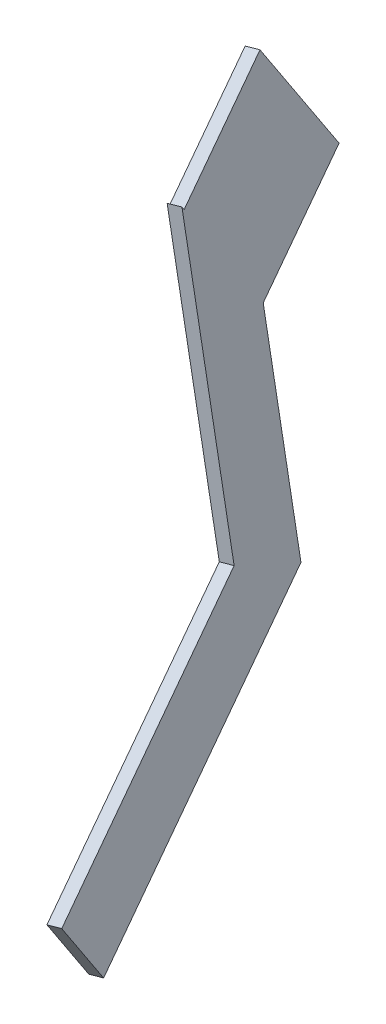
ISO-10303-21;
HEADER;
FILE_DESCRIPTION(('STEP AP214'),'2;1');
FILE_NAME('part.step','',(''),(''),'','','');
FILE_SCHEMA(('AUTOMOTIVE_DESIGN { 1 0 10303 214 1 1 1 1 }'));
ENDSEC;
DATA;
#1=APPLICATION_CONTEXT('core data for automotive mechanical design processes');
#2=APPLICATION_PROTOCOL_DEFINITION('international standard','automotive_design',2000,#1);
#3=PRODUCT_CONTEXT('',#1,'mechanical');
#4=PRODUCT('Part','Part','',(#3));
#5=PRODUCT_RELATED_PRODUCT_CATEGORY('part','',(#4));
#6=PRODUCT_DEFINITION_FORMATION('','',#4);
#7=PRODUCT_DEFINITION_CONTEXT('part definition',#1,'design');
#8=PRODUCT_DEFINITION('design','',#6,#7);
#9=PRODUCT_DEFINITION_SHAPE('','',#8);
#10=(LENGTH_UNIT() NAMED_UNIT(*) SI_UNIT(.MILLI.,.METRE.));
#11=(NAMED_UNIT(*) PLANE_ANGLE_UNIT() SI_UNIT($,.RADIAN.));
#12=(NAMED_UNIT(*) SI_UNIT($,.STERADIAN.) SOLID_ANGLE_UNIT());
#13=UNCERTAINTY_MEASURE_WITH_UNIT(LENGTH_MEASURE(1.E-05),#10,'distance_accuracy_value','');
#14=(GEOMETRIC_REPRESENTATION_CONTEXT(3) GLOBAL_UNCERTAINTY_ASSIGNED_CONTEXT((#13)) GLOBAL_UNIT_ASSIGNED_CONTEXT((#10,
#11,#12)) REPRESENTATION_CONTEXT('',''));
#15=CARTESIAN_POINT('',(0.,0.,0.));
#16=DIRECTION('',(0.,0.,1.));
#17=DIRECTION('',(1.,0.,0.));
#18=AXIS2_PLACEMENT_3D('',#15,#16,#17);
#19=CARTESIAN_POINT('',(5.31176497403256,-389.635259632626,105.833297296979));
#20=DIRECTION('',(-0.233089191441155,0.53411353830883,-0.812645160588883));
#21=DIRECTION('',(0.,0.835663201942741,0.54924221698519));
#22=AXIS2_PLACEMENT_3D('',#19,#20,#21);
#23=PLANE('',#22);
#24=DIRECTION('',(0.,-0.835663201942741,-0.54924221698519));
#25=VECTOR('',#24,1.);
#26=CARTESIAN_POINT('',(0.449488169814938,-390.275371753938,106.807217597269));
#27=LINE('',#26,#25);
#28=CARTESIAN_POINT('',(0.449488169814938,-390.275371753938,106.807217597269));
#29=VERTEX_POINT('',#28);
#30=CARTESIAN_POINT('',(0.449488169814938,-391.577302615747,105.951519522687));
#31=VERTEX_POINT('',#30);
#32=EDGE_CURVE('E137',#29,#31,#27,.T.);
#33=ORIENTED_EDGE('',*,*,#32,.F.);
#34=DIRECTION('',(-0.972455360843524,-0.128022424262425,0.19478406005796));
#35=VECTOR('',#34,1.);
#36=CARTESIAN_POINT('',(5.31176497403256,-389.635259632626,105.833297296979));
#37=LINE('',#36,#35);
#38=CARTESIAN_POINT('',(5.31176497403256,-389.635259632626,105.833297296979));
#39=VERTEX_POINT('',#38);
#40=EDGE_CURVE('E11',#39,#29,#37,.T.);
#41=ORIENTED_EDGE('',*,*,#40,.F.);
#42=DIRECTION('',(0.,-0.835663201942741,-0.54924221698519));
#43=VECTOR('',#42,1.);
#44=CARTESIAN_POINT('',(5.31176497403256,-389.635259632626,105.833297296979));
#45=LINE('',#44,#43);
#46=CARTESIAN_POINT('',(5.31176497403256,-390.937190494435,104.977599222397));
#47=VERTEX_POINT('',#46);
#48=EDGE_CURVE('E160',#39,#47,#45,.T.);
#49=ORIENTED_EDGE('',*,*,#48,.T.);
#50=DIRECTION('',(-0.972455360843524,-0.128022424262425,0.19478406005796));
#51=VECTOR('',#50,1.);
#52=CARTESIAN_POINT('',(5.31176497403256,-390.937190494435,104.977599222397));
#53=LINE('',#52,#51);
#54=EDGE_CURVE('E37',#47,#31,#53,.T.);
#55=ORIENTED_EDGE('',*,*,#54,.T.);
#56=EDGE_LOOP('',(#33,#41,#49,#55));
#57=FACE_BOUND('',#56,.T.);
#58=ADVANCED_FACE('F34',(#57),#23,.T.);
#59=CARTESIAN_POINT('',(5.31176497403256,-389.635259632626,105.833297296979));
#60=DIRECTION('',(0.199796433050453,-0.0274262930988744,0.979453512825989));
#61=DIRECTION('',(0.979822094001318,0.,-0.199871619063016));
#62=AXIS2_PLACEMENT_3D('',#59,#60,#61);
#63=PLANE('',#62);
#64=DIRECTION('',(-0.120049808442193,0.99139197965932,0.0522492694701705));
#65=VECTOR('',#64,1.);
#66=CARTESIAN_POINT('',(0.449488169814938,-390.275371753938,106.807217597269));
#67=LINE('',#66,#65);
#68=CARTESIAN_POINT('',(14.763018810499,-508.478971259181,100.577540688831));
#69=VERTEX_POINT('',#68);
#70=EDGE_CURVE('E158',#69,#29,#67,.T.);
#71=ORIENTED_EDGE('',*,*,#70,.F.);
#72=DIRECTION('',(-0.972455360843524,-0.128022424262425,0.19478406005796));
#73=VECTOR('',#72,1.);
#74=CARTESIAN_POINT('',(19.6252956147166,-507.838859137869,99.6036203885415));
#75=LINE('',#74,#73);
#76=CARTESIAN_POINT('',(19.6252956147166,-507.838859137869,99.6036203885415));
#77=VERTEX_POINT('',#76);
#78=EDGE_CURVE('E43',#77,#69,#75,.T.);
#79=ORIENTED_EDGE('',*,*,#78,.F.);
#80=DIRECTION('',(-0.120049808442193,0.99139197965932,0.0522492694701705));
#81=VECTOR('',#80,1.);
#82=CARTESIAN_POINT('',(5.31176497403256,-389.635259632626,105.833297296979));
#83=LINE('',#82,#81);
#84=EDGE_CURVE('E127',#77,#39,#83,.T.);
#85=ORIENTED_EDGE('',*,*,#84,.T.);
#86=ORIENTED_EDGE('',*,*,#40,.T.);
#87=EDGE_LOOP('',(#71,#79,#85,#86));
#88=FACE_BOUND('',#87,.T.);
#89=ADVANCED_FACE('F174',(#88),#63,.T.);
#90=CARTESIAN_POINT('',(19.6252956147166,-507.838859137869,99.6036203885415));
#91=DIRECTION('',(0.,0.835663201942739,0.549242216985193));
#92=DIRECTION('',(0.,-0.549242216985193,0.835663201942739));
#93=AXIS2_PLACEMENT_3D('',#90,#91,#92);
#94=PLANE('',#93);
#95=DIRECTION('',(-0.233089191441155,0.534113538308833,-0.81264516058888));
#96=VECTOR('',#95,1.);
#97=CARTESIAN_POINT('',(14.763018810499,-508.478971259181,100.577540688831));
#98=LINE('',#97,#96);
#99=CARTESIAN_POINT('',(42.0544055204392,-571.01597278583,195.726582986623));
#100=VERTEX_POINT('',#99);
#101=EDGE_CURVE('E114',#100,#69,#98,.T.);
#102=ORIENTED_EDGE('',*,*,#101,.F.);
#103=DIRECTION('',(-0.972455360843524,-0.128022424262425,0.19478406005796));
#104=VECTOR('',#103,1.);
#105=CARTESIAN_POINT('',(46.9166823246568,-570.375860664518,194.752662686333));
#106=LINE('',#105,#104);
#107=CARTESIAN_POINT('',(46.9166823246568,-570.375860664518,194.752662686333));
#108=VERTEX_POINT('',#107);
#109=EDGE_CURVE('E109',#108,#100,#106,.T.);
#110=ORIENTED_EDGE('',*,*,#109,.F.);
#111=DIRECTION('',(-0.233089191441155,0.534113538308833,-0.81264516058888));
#112=VECTOR('',#111,1.);
#113=CARTESIAN_POINT('',(19.6252956147166,-507.838859137869,99.6036203885415));
#114=LINE('',#113,#112);
#115=EDGE_CURVE('E112',#108,#77,#114,.T.);
#116=ORIENTED_EDGE('',*,*,#115,.T.);
#117=ORIENTED_EDGE('',*,*,#78,.T.);
#118=EDGE_LOOP('',(#102,#110,#116,#117));
#119=FACE_BOUND('',#118,.T.);
#120=ADVANCED_FACE('F111',(#119),#94,.T.);
#121=CARTESIAN_POINT('',(46.9166823246567,-595.4457567228,178.275396176777));
#122=DIRECTION('',(0.233089191441155,-0.534113538308845,0.812645160588873));
#123=DIRECTION('',(0.,-0.835663201942731,-0.549242216985205));
#124=AXIS2_PLACEMENT_3D('',#121,#122,#123);
#125=PLANE('',#124);
#126=DIRECTION('',(0.,0.835663201942731,0.549242216985204));
#127=VECTOR('',#126,1.);
#128=CARTESIAN_POINT('',(42.0544055204391,-596.085868844112,179.249316477067));
#129=LINE('',#128,#127);
#130=CARTESIAN_POINT('',(42.0544055204391,-596.085868844112,179.249316477067));
#131=VERTEX_POINT('',#130);
#132=EDGE_CURVE('E155',#131,#100,#129,.T.);
#133=ORIENTED_EDGE('',*,*,#132,.F.);
#134=DIRECTION('',(-0.972455360843524,-0.128022424262425,0.19478406005796));
#135=VECTOR('',#134,1.);
#136=CARTESIAN_POINT('',(46.9166823246567,-595.4457567228,178.275396176777));
#137=LINE('',#136,#135);
#138=CARTESIAN_POINT('',(46.9166823246567,-595.4457567228,178.275396176777));
#139=VERTEX_POINT('',#138);
#140=EDGE_CURVE('E119',#139,#131,#137,.T.);
#141=ORIENTED_EDGE('',*,*,#140,.F.);
#142=DIRECTION('',(0.,0.835663201942731,0.549242216985204));
#143=VECTOR('',#142,1.);
#144=CARTESIAN_POINT('',(46.9166823246567,-595.4457567228,178.275396176777));
#145=LINE('',#144,#143);
#146=EDGE_CURVE('E125',#139,#108,#145,.T.);
#147=ORIENTED_EDGE('',*,*,#146,.T.);
#148=ORIENTED_EDGE('',*,*,#109,.T.);
#149=EDGE_LOOP('',(#133,#141,#147,#148));
#150=FACE_BOUND('',#149,.T.);
#151=ADVANCED_FACE('F129',(#150),#125,.T.);
#152=CARTESIAN_POINT('',(15.6690300325005,-523.843148183051,69.3331785733692));
#153=DIRECTION('',(0.,-0.835663201942739,-0.549242216985192));
#154=DIRECTION('',(0.,0.549242216985192,-0.835663201942739));
#155=AXIS2_PLACEMENT_3D('',#152,#153,#154);
#156=PLANE('',#155);
#157=DIRECTION('',(0.233089191441155,-0.534113538308833,0.812645160588881));
#158=VECTOR('',#157,1.);
#159=CARTESIAN_POINT('',(10.8067532282829,-524.483260304363,70.307098873659));
#160=LINE('',#159,#158);
#161=CARTESIAN_POINT('',(10.8067532282829,-524.483260304363,70.307098873659));
#162=VERTEX_POINT('',#161);
#163=EDGE_CURVE('E152',#162,#131,#160,.T.);
#164=ORIENTED_EDGE('',*,*,#163,.F.);
#165=DIRECTION('',(-0.972455360843524,-0.128022424262425,0.19478406005796));
#166=VECTOR('',#165,1.);
#167=CARTESIAN_POINT('',(15.6690300325005,-523.843148183051,69.3331785733692));
#168=LINE('',#167,#166);
#169=CARTESIAN_POINT('',(15.6690300325005,-523.843148183051,69.3331785733692));
#170=VERTEX_POINT('',#169);
#171=EDGE_CURVE('E164',#170,#162,#168,.T.);
#172=ORIENTED_EDGE('',*,*,#171,.F.);
#173=DIRECTION('',(0.233089191441155,-0.534113538308833,0.812645160588881));
#174=VECTOR('',#173,1.);
#175=CARTESIAN_POINT('',(15.6690300325005,-523.843148183051,69.3331785733692));
#176=LINE('',#175,#174);
#177=EDGE_CURVE('E130',#170,#139,#176,.T.);
#178=ORIENTED_EDGE('',*,*,#177,.T.);
#179=ORIENTED_EDGE('',*,*,#140,.T.);
#180=EDGE_LOOP('',(#164,#172,#178,#179));
#181=FACE_BOUND('',#180,.T.);
#182=ADVANCED_FACE('F187',(#181),#156,.T.);
#183=CARTESIAN_POINT('',(5.3117649740325,-438.311070761076,73.8409702977888));
#184=DIRECTION('',(-0.199796433050453,0.0274262930988743,-0.979453512825989));
#185=DIRECTION('',(-0.979822094001318,0.,0.199871619063016));
#186=AXIS2_PLACEMENT_3D('',#183,#184,#185);
#187=PLANE('',#186);
#188=DIRECTION('',(0.120049808442193,-0.99139197965932,-0.0522492694701704));
#189=VECTOR('',#188,1.);
#190=CARTESIAN_POINT('',(0.449488169814882,-438.951182882388,74.8148905980786));
#191=LINE('',#190,#189);
#192=CARTESIAN_POINT('',(0.449488169814882,-438.951182882388,74.8148905980786));
#193=VERTEX_POINT('',#192);
#194=EDGE_CURVE('E149',#193,#162,#191,.T.);
#195=ORIENTED_EDGE('',*,*,#194,.F.);
#196=DIRECTION('',(-0.972455360843524,-0.128022424262425,0.19478406005796));
#197=VECTOR('',#196,1.);
#198=CARTESIAN_POINT('',(5.3117649740325,-438.311070761076,73.8409702977888));
#199=LINE('',#198,#197);
#200=CARTESIAN_POINT('',(5.3117649740325,-438.311070761076,73.8409702977888));
#201=VERTEX_POINT('',#200);
#202=EDGE_CURVE('E166',#201,#193,#199,.T.);
#203=ORIENTED_EDGE('',*,*,#202,.F.);
#204=DIRECTION('',(0.120049808442193,-0.99139197965932,-0.0522492694701704));
#205=VECTOR('',#204,1.);
#206=CARTESIAN_POINT('',(5.3117649740325,-438.311070761076,73.8409702977888));
#207=LINE('',#206,#205);
#208=EDGE_CURVE('E132',#201,#170,#207,.T.);
#209=ORIENTED_EDGE('',*,*,#208,.T.);
#210=ORIENTED_EDGE('',*,*,#171,.T.);
#211=EDGE_LOOP('',(#195,#203,#209,#210));
#212=FACE_BOUND('',#211,.T.);
#213=ADVANCED_FACE('F190',(#212),#187,.T.);
#214=CARTESIAN_POINT('',(5.3117649740325,-438.311070761076,73.8409702977888));
#215=DIRECTION('',(0.,-0.83566320194274,-0.54924221698519));
#216=DIRECTION('',(0.,0.54924221698519,-0.83566320194274));
#217=AXIS2_PLACEMENT_3D('',#214,#215,#216);
#218=PLANE('',#217);
#219=DIRECTION('',(0.233089191441155,-0.534113538308831,0.812645160588882));
#220=VECTOR('',#219,1.);
#221=CARTESIAN_POINT('',(0.449488169814882,-438.951182882388,74.8148905980786));
#222=LINE('',#221,#220);
#223=CARTESIAN_POINT('',(-11.5636917536966,-411.423514200646,32.9319853129158));
#224=VERTEX_POINT('',#223);
#225=EDGE_CURVE('E146',#224,#193,#222,.T.);
#226=ORIENTED_EDGE('',*,*,#225,.F.);
#227=DIRECTION('',(-0.972455360843524,-0.128022424262425,0.19478406005796));
#228=VECTOR('',#227,1.);
#229=CARTESIAN_POINT('',(-6.70141494947894,-410.783402079334,31.958065012626));
#230=LINE('',#229,#228);
#231=CARTESIAN_POINT('',(-6.70141494947894,-410.783402079334,31.958065012626));
#232=VERTEX_POINT('',#231);
#233=EDGE_CURVE('E168',#232,#224,#230,.T.);
#234=ORIENTED_EDGE('',*,*,#233,.F.);
#235=DIRECTION('',(0.233089191441155,-0.534113538308831,0.812645160588882));
#236=VECTOR('',#235,1.);
#237=CARTESIAN_POINT('',(5.3117649740325,-438.311070761076,73.8409702977888));
#238=LINE('',#237,#236);
#239=EDGE_CURVE('E275',#232,#201,#238,.T.);
#240=ORIENTED_EDGE('',*,*,#239,.T.);
#241=ORIENTED_EDGE('',*,*,#202,.T.);
#242=EDGE_LOOP('',(#226,#234,#240,#241));
#243=FACE_BOUND('',#242,.T.);
#244=ADVANCED_FACE('F194',(#243),#218,.T.);
#245=CARTESIAN_POINT('',(-6.70141494947894,-410.783402079334,31.958065012626));
#246=DIRECTION('',(-0.233089191441155,0.534113538308831,-0.812645160588882));
#247=DIRECTION('',(0.,0.83566320194274,0.54924221698519));
#248=AXIS2_PLACEMENT_3D('',#245,#246,#247);
#249=PLANE('',#248);
#250=DIRECTION('',(0.,-0.83566320194274,-0.549242216985191));
#251=VECTOR('',#250,1.);
#252=CARTESIAN_POINT('',(-11.5636917536966,-411.423514200646,32.9319853129158));
#253=LINE('',#252,#251);
#254=CARTESIAN_POINT('',(-11.5636917536965,-364.049633934004,64.0686142375239));
#255=VERTEX_POINT('',#254);
#256=EDGE_CURVE('E143',#255,#224,#253,.T.);
#257=ORIENTED_EDGE('',*,*,#256,.F.);
#258=DIRECTION('',(-0.972455360843524,-0.128022424262425,0.19478406005796));
#259=VECTOR('',#258,1.);
#260=CARTESIAN_POINT('',(-6.70141494947891,-363.409521812692,63.0946939372341));
#261=LINE('',#260,#259);
#262=CARTESIAN_POINT('',(-6.70141494947891,-363.409521812692,63.0946939372341));
#263=VERTEX_POINT('',#262);
#264=EDGE_CURVE('E169',#263,#255,#261,.T.);
#265=ORIENTED_EDGE('',*,*,#264,.F.);
#266=DIRECTION('',(0.,-0.83566320194274,-0.549242216985191));
#267=VECTOR('',#266,1.);
#268=CARTESIAN_POINT('',(-6.70141494947894,-410.783402079334,31.958065012626));
#269=LINE('',#268,#267);
#270=EDGE_CURVE('E279',#263,#232,#269,.T.);
#271=ORIENTED_EDGE('',*,*,#270,.T.);
#272=ORIENTED_EDGE('',*,*,#233,.T.);
#273=EDGE_LOOP('',(#257,#265,#271,#272));
#274=FACE_BOUND('',#273,.T.);
#275=ADVANCED_FACE('F198',(#274),#249,.T.);
#276=CARTESIAN_POINT('',(5.31176497403256,-390.937190494435,104.977599222397));
#277=DIRECTION('',(0.,0.835663201942741,0.54924221698519));
#278=DIRECTION('',(0.,-0.54924221698519,0.835663201942741));
#279=AXIS2_PLACEMENT_3D('',#276,#277,#278);
#280=PLANE('',#279);
#281=DIRECTION('',(-0.233089191441155,0.53411353830883,-0.812645160588882));
#282=VECTOR('',#281,1.);
#283=CARTESIAN_POINT('',(0.449488169814938,-391.577302615747,105.951519522687));
#284=LINE('',#283,#282);
#285=EDGE_CURVE('E140',#31,#255,#284,.T.);
#286=ORIENTED_EDGE('',*,*,#285,.F.);
#287=ORIENTED_EDGE('',*,*,#54,.F.);
#288=DIRECTION('',(-0.233089191441155,0.53411353830883,-0.812645160588882));
#289=VECTOR('',#288,1.);
#290=CARTESIAN_POINT('',(5.31176497403256,-390.937190494435,104.977599222397));
#291=LINE('',#290,#289);
#292=EDGE_CURVE('E283',#47,#263,#291,.T.);
#293=ORIENTED_EDGE('',*,*,#292,.T.);
#294=ORIENTED_EDGE('',*,*,#264,.T.);
#295=EDGE_LOOP('',(#286,#287,#293,#294));
#296=FACE_BOUND('',#295,.T.);
#297=ADVANCED_FACE('F171',(#296),#280,.T.);
#298=CARTESIAN_POINT('',(-63.5317102202948,-8.36386315242782,12.7254833048589));
#299=DIRECTION('',(0.972455360843524,0.128022424262425,-0.19478406005796));
#300=DIRECTION('',(-0.196400183457513,0.,-0.980523823238301));
#301=AXIS2_PLACEMENT_3D('',#298,#299,#300);
#302=PLANE('',#301);
#303=ORIENTED_EDGE('',*,*,#48,.F.);
#304=ORIENTED_EDGE('',*,*,#84,.F.);
#305=ORIENTED_EDGE('',*,*,#115,.F.);
#306=ORIENTED_EDGE('',*,*,#146,.F.);
#307=ORIENTED_EDGE('',*,*,#177,.F.);
#308=ORIENTED_EDGE('',*,*,#208,.F.);
#309=ORIENTED_EDGE('',*,*,#239,.F.);
#310=ORIENTED_EDGE('',*,*,#270,.F.);
#311=ORIENTED_EDGE('',*,*,#292,.F.);
#312=EDGE_LOOP('',(#303,#304,#305,#306,#307,#308,#309,#310,#311));
#313=FACE_BOUND('',#312,.T.);
#314=ADVANCED_FACE('F123',(#313),#302,.T.);
#315=CARTESIAN_POINT('',(-68.3939870245124,-9.00397527373995,13.6994036051487));
#316=DIRECTION('',(0.972455360843524,0.128022424262425,-0.19478406005796));
#317=DIRECTION('',(-0.196400183457513,0.,-0.980523823238301));
#318=AXIS2_PLACEMENT_3D('',#315,#316,#317);
#319=PLANE('',#318);
#320=ORIENTED_EDGE('',*,*,#32,.T.);
#321=ORIENTED_EDGE('',*,*,#285,.T.);
#322=ORIENTED_EDGE('',*,*,#256,.T.);
#323=ORIENTED_EDGE('',*,*,#225,.T.);
#324=ORIENTED_EDGE('',*,*,#194,.T.);
#325=ORIENTED_EDGE('',*,*,#163,.T.);
#326=ORIENTED_EDGE('',*,*,#132,.T.);
#327=ORIENTED_EDGE('',*,*,#101,.T.);
#328=ORIENTED_EDGE('',*,*,#70,.T.);
#329=EDGE_LOOP('',(#320,#321,#322,#323,#324,#325,#326,#327,#328));
#330=FACE_BOUND('',#329,.T.);
#331=ADVANCED_FACE('F173',(#330),#319,.F.);
#332=CLOSED_SHELL('',(#58,#89,#120,#151,#182,#213,#244,#275,#297,#314,#331));
#333=MANIFOLD_SOLID_BREP('B2',#332);
#334=ADVANCED_BREP_SHAPE_REPRESENTATION('',(#18,#333),#14);
#335=SHAPE_DEFINITION_REPRESENTATION(#9,#334);
ENDSEC;
END-ISO-10303-21;
